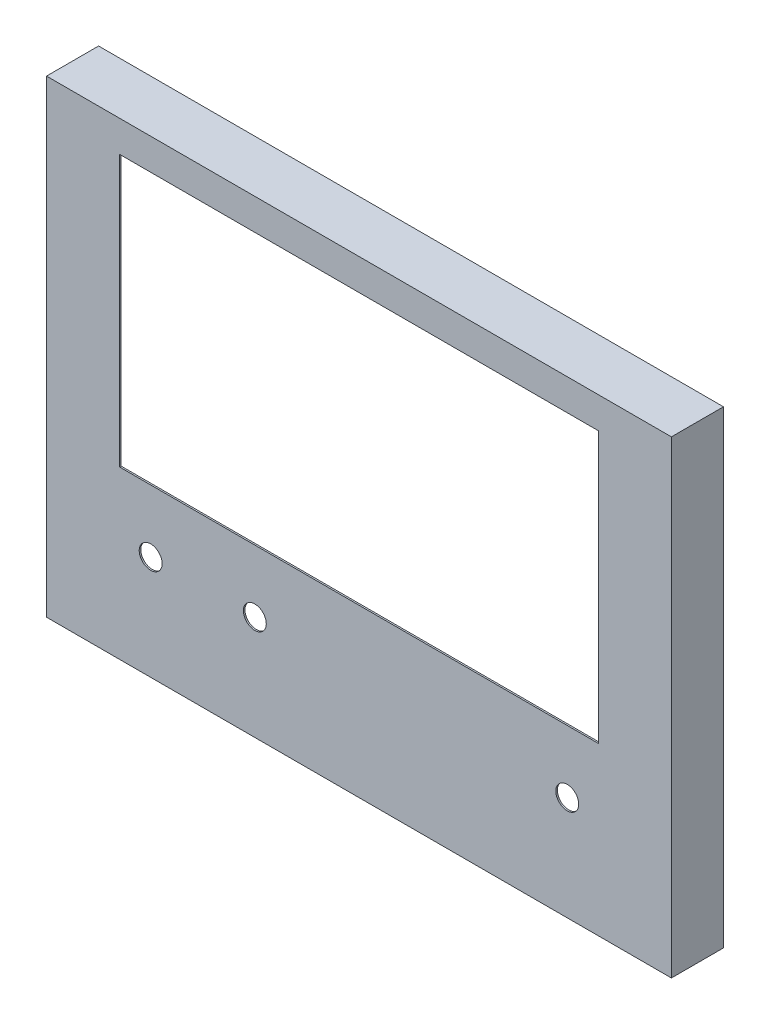
ISO-10303-21;
HEADER;
FILE_DESCRIPTION(('STEP AP214'),'2;1');
FILE_NAME('part.step','',(''),(''),'','','');
FILE_SCHEMA(('AUTOMOTIVE_DESIGN { 1 0 10303 214 1 1 1 1 }'));
ENDSEC;
DATA;
#1=APPLICATION_CONTEXT('core data for automotive mechanical design processes');
#2=APPLICATION_PROTOCOL_DEFINITION('international standard','automotive_design',2000,#1);
#3=PRODUCT_CONTEXT('',#1,'mechanical');
#4=PRODUCT('Part','Part','',(#3));
#5=PRODUCT_RELATED_PRODUCT_CATEGORY('part','',(#4));
#6=PRODUCT_DEFINITION_FORMATION('','',#4);
#7=PRODUCT_DEFINITION_CONTEXT('part definition',#1,'design');
#8=PRODUCT_DEFINITION('design','',#6,#7);
#9=PRODUCT_DEFINITION_SHAPE('','',#8);
#10=(LENGTH_UNIT() NAMED_UNIT(*) SI_UNIT(.MILLI.,.METRE.));
#11=(NAMED_UNIT(*) PLANE_ANGLE_UNIT() SI_UNIT($,.RADIAN.));
#12=(NAMED_UNIT(*) SI_UNIT($,.STERADIAN.) SOLID_ANGLE_UNIT());
#13=UNCERTAINTY_MEASURE_WITH_UNIT(LENGTH_MEASURE(1.E-05),#10,'distance_accuracy_value','');
#14=(GEOMETRIC_REPRESENTATION_CONTEXT(3) GLOBAL_UNCERTAINTY_ASSIGNED_CONTEXT((#13)) GLOBAL_UNIT_ASSIGNED_CONTEXT((#10,
#11,#12)) REPRESENTATION_CONTEXT('',''));
#15=CARTESIAN_POINT('',(0.,0.,0.));
#16=DIRECTION('',(0.,0.,1.));
#17=DIRECTION('',(1.,0.,0.));
#18=AXIS2_PLACEMENT_3D('',#15,#16,#17);
#19=CARTESIAN_POINT('',(0.,0.,48.5));
#20=DIRECTION('',(0.,0.,-1.));
#21=DIRECTION('',(-1.,0.,0.));
#22=AXIS2_PLACEMENT_3D('',#19,#20,#21);
#23=PLANE('',#22);
#24=CARTESIAN_POINT('',(-200.,-125.,48.5));
#25=DIRECTION('',(0.,0.,-1.));
#26=DIRECTION('',(-1.,0.,0.));
#27=AXIS2_PLACEMENT_3D('',#24,#25,#26);
#28=CIRCLE('',#27,11.);
#29=CARTESIAN_POINT('',(-211.,-125.,48.5));
#30=VERTEX_POINT('',#29);
#31=EDGE_CURVE('E397',#30,#30,#28,.F.);
#32=ORIENTED_EDGE('',*,*,#31,.T.);
#33=EDGE_LOOP('',(#32));
#34=FACE_BOUND('',#33,.T.);
#35=CARTESIAN_POINT('',(200.,-125.,48.5));
#36=DIRECTION('',(0.,0.,-1.));
#37=DIRECTION('',(-1.,0.,0.));
#38=AXIS2_PLACEMENT_3D('',#35,#36,#37);
#39=CIRCLE('',#38,11.);
#40=CARTESIAN_POINT('',(189.,-125.,48.5));
#41=VERTEX_POINT('',#40);
#42=EDGE_CURVE('E407',#41,#41,#39,.F.);
#43=ORIENTED_EDGE('',*,*,#42,.T.);
#44=EDGE_LOOP('',(#43));
#45=FACE_BOUND('',#44,.T.);
#46=CARTESIAN_POINT('',(-100.,-125.,48.5));
#47=DIRECTION('',(0.,0.,-1.));
#48=DIRECTION('',(-1.,0.,0.));
#49=AXIS2_PLACEMENT_3D('',#46,#47,#48);
#50=CIRCLE('',#49,11.);
#51=CARTESIAN_POINT('',(-111.,-125.,48.5));
#52=VERTEX_POINT('',#51);
#53=EDGE_CURVE('E413',#52,#52,#50,.F.);
#54=ORIENTED_EDGE('',*,*,#53,.T.);
#55=EDGE_LOOP('',(#54));
#56=FACE_BOUND('',#55,.T.);
#57=DIRECTION('',(0.,-1.,0.));
#58=VECTOR('',#57,1.);
#59=CARTESIAN_POINT('',(-298.5,0.,48.5));
#60=LINE('',#59,#58);
#61=CARTESIAN_POINT('',(-298.5,223.5,48.5));
#62=VERTEX_POINT('',#61);
#63=CARTESIAN_POINT('',(-298.5,-223.5,48.5));
#64=VERTEX_POINT('',#63);
#65=EDGE_CURVE('E160',#62,#64,#60,.T.);
#66=ORIENTED_EDGE('',*,*,#65,.F.);
#67=DIRECTION('',(-1.,0.,0.));
#68=VECTOR('',#67,1.);
#69=CARTESIAN_POINT('',(0.,223.5,48.5));
#70=LINE('',#69,#68);
#71=CARTESIAN_POINT('',(298.5,223.5,48.5));
#72=VERTEX_POINT('',#71);
#73=EDGE_CURVE('E168',#72,#62,#70,.T.);
#74=ORIENTED_EDGE('',*,*,#73,.F.);
#75=DIRECTION('',(0.,1.,0.));
#76=VECTOR('',#75,1.);
#77=CARTESIAN_POINT('',(298.5,0.,48.5));
#78=LINE('',#77,#76);
#79=CARTESIAN_POINT('',(298.5,-223.5,48.5));
#80=VERTEX_POINT('',#79);
#81=EDGE_CURVE('E172',#80,#72,#78,.T.);
#82=ORIENTED_EDGE('',*,*,#81,.F.);
#83=DIRECTION('',(1.,0.,0.));
#84=VECTOR('',#83,1.);
#85=CARTESIAN_POINT('',(0.,-223.5,48.5));
#86=LINE('',#85,#84);
#87=EDGE_CURVE('E163',#64,#80,#86,.T.);
#88=ORIENTED_EDGE('',*,*,#87,.F.);
#89=EDGE_LOOP('',(#66,#74,#82,#88));
#90=FACE_BOUND('',#89,.T.);
#91=DIRECTION('',(-1.,0.,0.));
#92=VECTOR('',#91,1.);
#93=CARTESIAN_POINT('',(-230.,195.,48.5));
#94=LINE('',#93,#92);
#95=CARTESIAN_POINT('',(230.,195.,48.5));
#96=VERTEX_POINT('',#95);
#97=CARTESIAN_POINT('',(-230.,195.,48.5));
#98=VERTEX_POINT('',#97);
#99=EDGE_CURVE('E137',#96,#98,#94,.T.);
#100=ORIENTED_EDGE('',*,*,#99,.T.);
#101=DIRECTION('',(0.,-1.,0.));
#102=VECTOR('',#101,1.);
#103=CARTESIAN_POINT('',(-230.,195.,48.5));
#104=LINE('',#103,#102);
#105=CARTESIAN_POINT('',(-230.,-64.9999999999999,48.5));
#106=VERTEX_POINT('',#105);
#107=EDGE_CURVE('E132',#98,#106,#104,.T.);
#108=ORIENTED_EDGE('',*,*,#107,.T.);
#109=DIRECTION('',(1.,0.,0.));
#110=VECTOR('',#109,1.);
#111=CARTESIAN_POINT('',(-230.,-64.9999999999999,48.5));
#112=LINE('',#111,#110);
#113=CARTESIAN_POINT('',(230.,-64.9999999999999,48.5));
#114=VERTEX_POINT('',#113);
#115=EDGE_CURVE('E121',#106,#114,#112,.T.);
#116=ORIENTED_EDGE('',*,*,#115,.T.);
#117=DIRECTION('',(0.,1.,0.));
#118=VECTOR('',#117,1.);
#119=CARTESIAN_POINT('',(230.,195.,48.5));
#120=LINE('',#119,#118);
#121=EDGE_CURVE('E141',#114,#96,#120,.T.);
#122=ORIENTED_EDGE('',*,*,#121,.T.);
#123=EDGE_LOOP('',(#100,#108,#116,#122));
#124=FACE_BOUND('',#123,.T.);
#125=ADVANCED_FACE('F33',(#34,#45,#56,#90,#124),#23,.T.);
#126=CARTESIAN_POINT('',(0.,0.,0.));
#127=DIRECTION('',(0.,0.,-1.));
#128=DIRECTION('',(-1.,0.,0.));
#129=AXIS2_PLACEMENT_3D('',#126,#127,#128);
#130=PLANE('',#129);
#131=DIRECTION('',(0.,-1.,0.));
#132=VECTOR('',#131,1.);
#133=CARTESIAN_POINT('',(-300.,225.,0.));
#134=LINE('',#133,#132);
#135=CARTESIAN_POINT('',(-300.,225.,0.));
#136=VERTEX_POINT('',#135);
#137=CARTESIAN_POINT('',(-300.,-225.,0.));
#138=VERTEX_POINT('',#137);
#139=EDGE_CURVE('E158',#136,#138,#134,.T.);
#140=ORIENTED_EDGE('',*,*,#139,.F.);
#141=DIRECTION('',(-1.,0.,0.));
#142=VECTOR('',#141,1.);
#143=CARTESIAN_POINT('',(300.,225.,0.));
#144=LINE('',#143,#142);
#145=CARTESIAN_POINT('',(300.,225.,0.));
#146=VERTEX_POINT('',#145);
#147=EDGE_CURVE('E190',#146,#136,#144,.T.);
#148=ORIENTED_EDGE('',*,*,#147,.F.);
#149=DIRECTION('',(0.,1.,0.));
#150=VECTOR('',#149,1.);
#151=CARTESIAN_POINT('',(300.,225.,0.));
#152=LINE('',#151,#150);
#153=CARTESIAN_POINT('',(300.,-225.,0.));
#154=VERTEX_POINT('',#153);
#155=EDGE_CURVE('E201',#154,#146,#152,.T.);
#156=ORIENTED_EDGE('',*,*,#155,.F.);
#157=DIRECTION('',(1.,0.,0.));
#158=VECTOR('',#157,1.);
#159=CARTESIAN_POINT('',(300.,-225.,0.));
#160=LINE('',#159,#158);
#161=EDGE_CURVE('E199',#138,#154,#160,.T.);
#162=ORIENTED_EDGE('',*,*,#161,.F.);
#163=EDGE_LOOP('',(#140,#148,#156,#162));
#164=FACE_BOUND('',#163,.T.);
#165=DIRECTION('',(-1.,0.,0.));
#166=VECTOR('',#165,1.);
#167=CARTESIAN_POINT('',(0.,223.5,0.));
#168=LINE('',#167,#166);
#169=CARTESIAN_POINT('',(298.5,223.5,0.));
#170=VERTEX_POINT('',#169);
#171=CARTESIAN_POINT('',(-298.5,223.5,0.));
#172=VERTEX_POINT('',#171);
#173=EDGE_CURVE('E164',#170,#172,#168,.T.);
#174=ORIENTED_EDGE('',*,*,#173,.T.);
#175=DIRECTION('',(0.,-1.,0.));
#176=VECTOR('',#175,1.);
#177=CARTESIAN_POINT('',(-298.5,0.,0.));
#178=LINE('',#177,#176);
#179=CARTESIAN_POINT('',(-298.5,-223.5,0.));
#180=VERTEX_POINT('',#179);
#181=EDGE_CURVE('E128',#172,#180,#178,.T.);
#182=ORIENTED_EDGE('',*,*,#181,.T.);
#183=DIRECTION('',(1.,0.,0.));
#184=VECTOR('',#183,1.);
#185=CARTESIAN_POINT('',(0.,-223.5,0.));
#186=LINE('',#185,#184);
#187=CARTESIAN_POINT('',(298.5,-223.5,0.));
#188=VERTEX_POINT('',#187);
#189=EDGE_CURVE('E178',#180,#188,#186,.T.);
#190=ORIENTED_EDGE('',*,*,#189,.T.);
#191=DIRECTION('',(0.,1.,0.));
#192=VECTOR('',#191,1.);
#193=CARTESIAN_POINT('',(298.5,0.,0.));
#194=LINE('',#193,#192);
#195=EDGE_CURVE('E181',#188,#170,#194,.T.);
#196=ORIENTED_EDGE('',*,*,#195,.T.);
#197=EDGE_LOOP('',(#174,#182,#190,#196));
#198=FACE_BOUND('',#197,.T.);
#199=ADVANCED_FACE('F219',(#164,#198),#130,.T.);
#200=CARTESIAN_POINT('',(-300.,225.,50.));
#201=DIRECTION('',(1.,0.,0.));
#202=DIRECTION('',(0.,1.,0.));
#203=AXIS2_PLACEMENT_3D('',#200,#201,#202);
#204=PLANE('',#203);
#205=ORIENTED_EDGE('',*,*,#139,.T.);
#206=DIRECTION('',(0.,0.,-1.));
#207=VECTOR('',#206,1.);
#208=CARTESIAN_POINT('',(-300.,-225.,50.));
#209=LINE('',#208,#207);
#210=CARTESIAN_POINT('',(-300.,-225.,50.));
#211=VERTEX_POINT('',#210);
#212=EDGE_CURVE('E11',#211,#138,#209,.T.);
#213=ORIENTED_EDGE('',*,*,#212,.F.);
#214=DIRECTION('',(0.,-1.,0.));
#215=VECTOR('',#214,1.);
#216=CARTESIAN_POINT('',(-300.,225.,50.));
#217=LINE('',#216,#215);
#218=CARTESIAN_POINT('',(-300.,225.,50.));
#219=VERTEX_POINT('',#218);
#220=EDGE_CURVE('E186',#219,#211,#217,.T.);
#221=ORIENTED_EDGE('',*,*,#220,.F.);
#222=DIRECTION('',(0.,0.,-1.));
#223=VECTOR('',#222,1.);
#224=CARTESIAN_POINT('',(-300.,225.,50.));
#225=LINE('',#224,#223);
#226=EDGE_CURVE('E196',#219,#136,#225,.T.);
#227=ORIENTED_EDGE('',*,*,#226,.T.);
#228=EDGE_LOOP('',(#205,#213,#221,#227));
#229=FACE_BOUND('',#228,.T.);
#230=ADVANCED_FACE('F35',(#229),#204,.F.);
#231=CARTESIAN_POINT('',(300.,-225.,50.));
#232=DIRECTION('',(0.,1.,0.));
#233=DIRECTION('',(-1.,0.,0.));
#234=AXIS2_PLACEMENT_3D('',#231,#232,#233);
#235=PLANE('',#234);
#236=ORIENTED_EDGE('',*,*,#161,.T.);
#237=DIRECTION('',(0.,0.,-1.));
#238=VECTOR('',#237,1.);
#239=CARTESIAN_POINT('',(300.,-225.,50.));
#240=LINE('',#239,#238);
#241=CARTESIAN_POINT('',(300.,-225.,50.));
#242=VERTEX_POINT('',#241);
#243=EDGE_CURVE('E41',#242,#154,#240,.T.);
#244=ORIENTED_EDGE('',*,*,#243,.F.);
#245=DIRECTION('',(1.,0.,0.));
#246=VECTOR('',#245,1.);
#247=CARTESIAN_POINT('',(300.,-225.,50.));
#248=LINE('',#247,#246);
#249=EDGE_CURVE('E189',#211,#242,#248,.T.);
#250=ORIENTED_EDGE('',*,*,#249,.F.);
#251=ORIENTED_EDGE('',*,*,#212,.T.);
#252=EDGE_LOOP('',(#236,#244,#250,#251));
#253=FACE_BOUND('',#252,.T.);
#254=ADVANCED_FACE('F230',(#253),#235,.F.);
#255=CARTESIAN_POINT('',(300.,225.,50.));
#256=DIRECTION('',(-1.,0.,0.));
#257=DIRECTION('',(0.,-1.,0.));
#258=AXIS2_PLACEMENT_3D('',#255,#256,#257);
#259=PLANE('',#258);
#260=ORIENTED_EDGE('',*,*,#155,.T.);
#261=DIRECTION('',(0.,0.,-1.));
#262=VECTOR('',#261,1.);
#263=CARTESIAN_POINT('',(300.,225.,50.));
#264=LINE('',#263,#262);
#265=CARTESIAN_POINT('',(300.,225.,50.));
#266=VERTEX_POINT('',#265);
#267=EDGE_CURVE('E206',#266,#146,#264,.T.);
#268=ORIENTED_EDGE('',*,*,#267,.F.);
#269=DIRECTION('',(0.,1.,0.));
#270=VECTOR('',#269,1.);
#271=CARTESIAN_POINT('',(300.,225.,50.));
#272=LINE('',#271,#270);
#273=EDGE_CURVE('E192',#242,#266,#272,.T.);
#274=ORIENTED_EDGE('',*,*,#273,.F.);
#275=ORIENTED_EDGE('',*,*,#243,.T.);
#276=EDGE_LOOP('',(#260,#268,#274,#275));
#277=FACE_BOUND('',#276,.T.);
#278=ADVANCED_FACE('F213',(#277),#259,.F.);
#279=CARTESIAN_POINT('',(300.,225.,50.));
#280=DIRECTION('',(0.,-1.,0.));
#281=DIRECTION('',(1.,0.,0.));
#282=AXIS2_PLACEMENT_3D('',#279,#280,#281);
#283=PLANE('',#282);
#284=ORIENTED_EDGE('',*,*,#147,.T.);
#285=ORIENTED_EDGE('',*,*,#226,.F.);
#286=DIRECTION('',(-1.,0.,0.));
#287=VECTOR('',#286,1.);
#288=CARTESIAN_POINT('',(300.,225.,50.));
#289=LINE('',#288,#287);
#290=EDGE_CURVE('E194',#266,#219,#289,.T.);
#291=ORIENTED_EDGE('',*,*,#290,.F.);
#292=ORIENTED_EDGE('',*,*,#267,.T.);
#293=EDGE_LOOP('',(#284,#285,#291,#292));
#294=FACE_BOUND('',#293,.T.);
#295=ADVANCED_FACE('F223',(#294),#283,.F.);
#296=CARTESIAN_POINT('',(0.,0.,50.));
#297=DIRECTION('',(0.,0.,-1.));
#298=DIRECTION('',(-1.,0.,0.));
#299=AXIS2_PLACEMENT_3D('',#296,#297,#298);
#300=PLANE('',#299);
#301=CARTESIAN_POINT('',(-200.,-125.,50.));
#302=DIRECTION('',(0.,0.,1.));
#303=DIRECTION('',(1.,0.,0.));
#304=AXIS2_PLACEMENT_3D('',#301,#302,#303);
#305=CIRCLE('',#304,11.);
#306=CARTESIAN_POINT('',(-189.,-125.,50.));
#307=VERTEX_POINT('',#306);
#308=EDGE_CURVE('E400',#307,#307,#305,.T.);
#309=ORIENTED_EDGE('',*,*,#308,.F.);
#310=EDGE_LOOP('',(#309));
#311=FACE_BOUND('',#310,.T.);
#312=CARTESIAN_POINT('',(200.,-125.,50.));
#313=DIRECTION('',(0.,0.,1.));
#314=DIRECTION('',(1.,0.,0.));
#315=AXIS2_PLACEMENT_3D('',#312,#313,#314);
#316=CIRCLE('',#315,11.);
#317=CARTESIAN_POINT('',(211.,-125.,50.));
#318=VERTEX_POINT('',#317);
#319=EDGE_CURVE('E402',#318,#318,#316,.T.);
#320=ORIENTED_EDGE('',*,*,#319,.F.);
#321=EDGE_LOOP('',(#320));
#322=FACE_BOUND('',#321,.T.);
#323=CARTESIAN_POINT('',(-100.,-125.,50.));
#324=DIRECTION('',(0.,0.,1.));
#325=DIRECTION('',(1.,0.,0.));
#326=AXIS2_PLACEMENT_3D('',#323,#324,#325);
#327=CIRCLE('',#326,11.);
#328=CARTESIAN_POINT('',(-89.,-125.,50.));
#329=VERTEX_POINT('',#328);
#330=EDGE_CURVE('E410',#329,#329,#327,.T.);
#331=ORIENTED_EDGE('',*,*,#330,.F.);
#332=EDGE_LOOP('',(#331));
#333=FACE_BOUND('',#332,.T.);
#334=DIRECTION('',(1.,0.,0.));
#335=VECTOR('',#334,1.);
#336=CARTESIAN_POINT('',(-230.,-64.9999999999999,50.));
#337=LINE('',#336,#335);
#338=CARTESIAN_POINT('',(-230.,-64.9999999999999,50.));
#339=VERTEX_POINT('',#338);
#340=CARTESIAN_POINT('',(230.,-64.9999999999999,50.));
#341=VERTEX_POINT('',#340);
#342=EDGE_CURVE('E139',#339,#341,#337,.T.);
#343=ORIENTED_EDGE('',*,*,#342,.F.);
#344=DIRECTION('',(0.,-1.,0.));
#345=VECTOR('',#344,1.);
#346=CARTESIAN_POINT('',(-230.,195.,50.));
#347=LINE('',#346,#345);
#348=CARTESIAN_POINT('',(-230.,195.,50.));
#349=VERTEX_POINT('',#348);
#350=EDGE_CURVE('E56',#349,#339,#347,.T.);
#351=ORIENTED_EDGE('',*,*,#350,.F.);
#352=DIRECTION('',(-1.,0.,0.));
#353=VECTOR('',#352,1.);
#354=CARTESIAN_POINT('',(-230.,195.,50.));
#355=LINE('',#354,#353);
#356=CARTESIAN_POINT('',(230.,195.,50.));
#357=VERTEX_POINT('',#356);
#358=EDGE_CURVE('E134',#357,#349,#355,.T.);
#359=ORIENTED_EDGE('',*,*,#358,.F.);
#360=DIRECTION('',(0.,1.,0.));
#361=VECTOR('',#360,1.);
#362=CARTESIAN_POINT('',(230.,195.,50.));
#363=LINE('',#362,#361);
#364=EDGE_CURVE('E146',#341,#357,#363,.T.);
#365=ORIENTED_EDGE('',*,*,#364,.F.);
#366=EDGE_LOOP('',(#343,#351,#359,#365));
#367=FACE_BOUND('',#366,.T.);
#368=ORIENTED_EDGE('',*,*,#220,.T.);
#369=ORIENTED_EDGE('',*,*,#249,.T.);
#370=ORIENTED_EDGE('',*,*,#273,.T.);
#371=ORIENTED_EDGE('',*,*,#290,.T.);
#372=EDGE_LOOP('',(#368,#369,#370,#371));
#373=FACE_BOUND('',#372,.T.);
#374=ADVANCED_FACE('F229',(#311,#322,#333,#367,#373),#300,.F.);
#375=CARTESIAN_POINT('',(-298.5,225.,50.));
#376=DIRECTION('',(1.,0.,0.));
#377=DIRECTION('',(0.,1.,0.));
#378=AXIS2_PLACEMENT_3D('',#375,#376,#377);
#379=PLANE('',#378);
#380=ORIENTED_EDGE('',*,*,#181,.F.);
#381=DIRECTION('',(0.,0.,-1.));
#382=VECTOR('',#381,1.);
#383=CARTESIAN_POINT('',(-298.5,223.5,50.));
#384=LINE('',#383,#382);
#385=EDGE_CURVE('E165',#62,#172,#384,.T.);
#386=ORIENTED_EDGE('',*,*,#385,.F.);
#387=ORIENTED_EDGE('',*,*,#65,.T.);
#388=DIRECTION('',(0.,0.,-1.));
#389=VECTOR('',#388,1.);
#390=CARTESIAN_POINT('',(-298.5,-223.5,50.));
#391=LINE('',#390,#389);
#392=EDGE_CURVE('E155',#64,#180,#391,.T.);
#393=ORIENTED_EDGE('',*,*,#392,.T.);
#394=EDGE_LOOP('',(#380,#386,#387,#393));
#395=FACE_BOUND('',#394,.T.);
#396=ADVANCED_FACE('F252',(#395),#379,.T.);
#397=CARTESIAN_POINT('',(300.,-223.5,50.));
#398=DIRECTION('',(0.,1.,0.));
#399=DIRECTION('',(-1.,0.,0.));
#400=AXIS2_PLACEMENT_3D('',#397,#398,#399);
#401=PLANE('',#400);
#402=ORIENTED_EDGE('',*,*,#189,.F.);
#403=ORIENTED_EDGE('',*,*,#392,.F.);
#404=ORIENTED_EDGE('',*,*,#87,.T.);
#405=DIRECTION('',(0.,0.,-1.));
#406=VECTOR('',#405,1.);
#407=CARTESIAN_POINT('',(298.5,-223.5,50.));
#408=LINE('',#407,#406);
#409=EDGE_CURVE('E159',#80,#188,#408,.T.);
#410=ORIENTED_EDGE('',*,*,#409,.T.);
#411=EDGE_LOOP('',(#402,#403,#404,#410));
#412=FACE_BOUND('',#411,.T.);
#413=ADVANCED_FACE('F275',(#412),#401,.T.);
#414=CARTESIAN_POINT('',(298.5,225.,50.));
#415=DIRECTION('',(-1.,0.,0.));
#416=DIRECTION('',(0.,-1.,0.));
#417=AXIS2_PLACEMENT_3D('',#414,#415,#416);
#418=PLANE('',#417);
#419=ORIENTED_EDGE('',*,*,#195,.F.);
#420=ORIENTED_EDGE('',*,*,#409,.F.);
#421=ORIENTED_EDGE('',*,*,#81,.T.);
#422=DIRECTION('',(0.,0.,-1.));
#423=VECTOR('',#422,1.);
#424=CARTESIAN_POINT('',(298.5,223.5,50.));
#425=LINE('',#424,#423);
#426=EDGE_CURVE('E167',#72,#170,#425,.T.);
#427=ORIENTED_EDGE('',*,*,#426,.T.);
#428=EDGE_LOOP('',(#419,#420,#421,#427));
#429=FACE_BOUND('',#428,.T.);
#430=ADVANCED_FACE('F283',(#429),#418,.T.);
#431=CARTESIAN_POINT('',(300.,223.5,50.));
#432=DIRECTION('',(0.,-1.,0.));
#433=DIRECTION('',(1.,0.,0.));
#434=AXIS2_PLACEMENT_3D('',#431,#432,#433);
#435=PLANE('',#434);
#436=ORIENTED_EDGE('',*,*,#173,.F.);
#437=ORIENTED_EDGE('',*,*,#426,.F.);
#438=ORIENTED_EDGE('',*,*,#73,.T.);
#439=ORIENTED_EDGE('',*,*,#385,.T.);
#440=EDGE_LOOP('',(#436,#437,#438,#439));
#441=FACE_BOUND('',#440,.T.);
#442=ADVANCED_FACE('F250',(#441),#435,.T.);
#443=CARTESIAN_POINT('',(-230.,195.,-0.001000000000001));
#444=DIRECTION('',(-1.,0.,0.));
#445=DIRECTION('',(0.,-1.,0.));
#446=AXIS2_PLACEMENT_3D('',#443,#444,#445);
#447=PLANE('',#446);
#448=DIRECTION('',(0.,0.,1.));
#449=VECTOR('',#448,1.);
#450=CARTESIAN_POINT('',(-230.,195.,-0.001000000000001));
#451=LINE('',#450,#449);
#452=EDGE_CURVE('E129',#98,#349,#451,.T.);
#453=ORIENTED_EDGE('',*,*,#452,.T.);
#454=ORIENTED_EDGE('',*,*,#350,.T.);
#455=DIRECTION('',(0.,0.,1.));
#456=VECTOR('',#455,1.);
#457=CARTESIAN_POINT('',(-230.,-64.9999999999999,-0.001000000000001));
#458=LINE('',#457,#456);
#459=EDGE_CURVE('E123',#106,#339,#458,.T.);
#460=ORIENTED_EDGE('',*,*,#459,.F.);
#461=ORIENTED_EDGE('',*,*,#107,.F.);
#462=EDGE_LOOP('',(#453,#454,#460,#461));
#463=FACE_BOUND('',#462,.T.);
#464=ADVANCED_FACE('F131',(#463),#447,.F.);
#465=CARTESIAN_POINT('',(-230.,195.,-0.001000000000001));
#466=DIRECTION('',(0.,1.,0.));
#467=DIRECTION('',(0.,0.,1.));
#468=AXIS2_PLACEMENT_3D('',#465,#466,#467);
#469=PLANE('',#468);
#470=DIRECTION('',(0.,0.,1.));
#471=VECTOR('',#470,1.);
#472=CARTESIAN_POINT('',(230.,195.,-0.001000000000001));
#473=LINE('',#472,#471);
#474=EDGE_CURVE('E152',#96,#357,#473,.T.);
#475=ORIENTED_EDGE('',*,*,#474,.T.);
#476=ORIENTED_EDGE('',*,*,#358,.T.);
#477=ORIENTED_EDGE('',*,*,#452,.F.);
#478=ORIENTED_EDGE('',*,*,#99,.F.);
#479=EDGE_LOOP('',(#475,#476,#477,#478));
#480=FACE_BOUND('',#479,.T.);
#481=ADVANCED_FACE('F303',(#480),#469,.F.);
#482=CARTESIAN_POINT('',(230.,195.,-0.001000000000001));
#483=DIRECTION('',(1.,0.,0.));
#484=DIRECTION('',(0.,1.,0.));
#485=AXIS2_PLACEMENT_3D('',#482,#483,#484);
#486=PLANE('',#485);
#487=DIRECTION('',(0.,0.,1.));
#488=VECTOR('',#487,1.);
#489=CARTESIAN_POINT('',(230.,-64.9999999999999,-0.001000000000001));
#490=LINE('',#489,#488);
#491=EDGE_CURVE('E48',#114,#341,#490,.T.);
#492=ORIENTED_EDGE('',*,*,#491,.T.);
#493=ORIENTED_EDGE('',*,*,#364,.T.);
#494=ORIENTED_EDGE('',*,*,#474,.F.);
#495=ORIENTED_EDGE('',*,*,#121,.F.);
#496=EDGE_LOOP('',(#492,#493,#494,#495));
#497=FACE_BOUND('',#496,.T.);
#498=ADVANCED_FACE('F310',(#497),#486,.F.);
#499=CARTESIAN_POINT('',(-230.,-64.9999999999999,-0.001000000000001));
#500=DIRECTION('',(0.,-1.,0.));
#501=DIRECTION('',(0.,0.,-1.));
#502=AXIS2_PLACEMENT_3D('',#499,#500,#501);
#503=PLANE('',#502);
#504=ORIENTED_EDGE('',*,*,#459,.T.);
#505=ORIENTED_EDGE('',*,*,#342,.T.);
#506=ORIENTED_EDGE('',*,*,#491,.F.);
#507=ORIENTED_EDGE('',*,*,#115,.F.);
#508=EDGE_LOOP('',(#504,#505,#506,#507));
#509=FACE_BOUND('',#508,.T.);
#510=ADVANCED_FACE('F122',(#509),#503,.F.);
#511=CARTESIAN_POINT('',(-100.,-125.,-0.001000000000001));
#512=DIRECTION('',(0.,0.,1.));
#513=DIRECTION('',(1.,0.,0.));
#514=AXIS2_PLACEMENT_3D('',#511,#512,#513);
#515=CYLINDRICAL_SURFACE('',#514,11.);
#516=ORIENTED_EDGE('',*,*,#53,.F.);
#517=EDGE_LOOP('',(#516));
#518=FACE_BOUND('',#517,.T.);
#519=ORIENTED_EDGE('',*,*,#330,.T.);
#520=EDGE_LOOP('',(#519));
#521=FACE_BOUND('',#520,.T.);
#522=ADVANCED_FACE('F324',(#518,#521),#515,.F.);
#523=CARTESIAN_POINT('',(200.,-125.,-0.001000000000001));
#524=DIRECTION('',(0.,0.,1.));
#525=DIRECTION('',(1.,0.,0.));
#526=AXIS2_PLACEMENT_3D('',#523,#524,#525);
#527=CYLINDRICAL_SURFACE('',#526,11.);
#528=ORIENTED_EDGE('',*,*,#42,.F.);
#529=EDGE_LOOP('',(#528));
#530=FACE_BOUND('',#529,.T.);
#531=ORIENTED_EDGE('',*,*,#319,.T.);
#532=EDGE_LOOP('',(#531));
#533=FACE_BOUND('',#532,.T.);
#534=ADVANCED_FACE('F330',(#530,#533),#527,.F.);
#535=CARTESIAN_POINT('',(-200.,-125.,-0.001000000000001));
#536=DIRECTION('',(0.,0.,1.));
#537=DIRECTION('',(1.,0.,0.));
#538=AXIS2_PLACEMENT_3D('',#535,#536,#537);
#539=CYLINDRICAL_SURFACE('',#538,11.);
#540=ORIENTED_EDGE('',*,*,#31,.F.);
#541=EDGE_LOOP('',(#540));
#542=FACE_BOUND('',#541,.T.);
#543=ORIENTED_EDGE('',*,*,#308,.T.);
#544=EDGE_LOOP('',(#543));
#545=FACE_BOUND('',#544,.T.);
#546=ADVANCED_FACE('F338',(#542,#545),#539,.F.);
#547=CLOSED_SHELL('',(#125,#199,#230,#254,#278,#295,#374,#396,#413,#430,#442,#464,#481,#498,
#510,#522,#534,#546));
#548=MANIFOLD_SOLID_BREP('B2',#547);
#549=ADVANCED_BREP_SHAPE_REPRESENTATION('',(#18,#548),#14);
#550=SHAPE_DEFINITION_REPRESENTATION(#9,#549);
ENDSEC;
END-ISO-10303-21;
